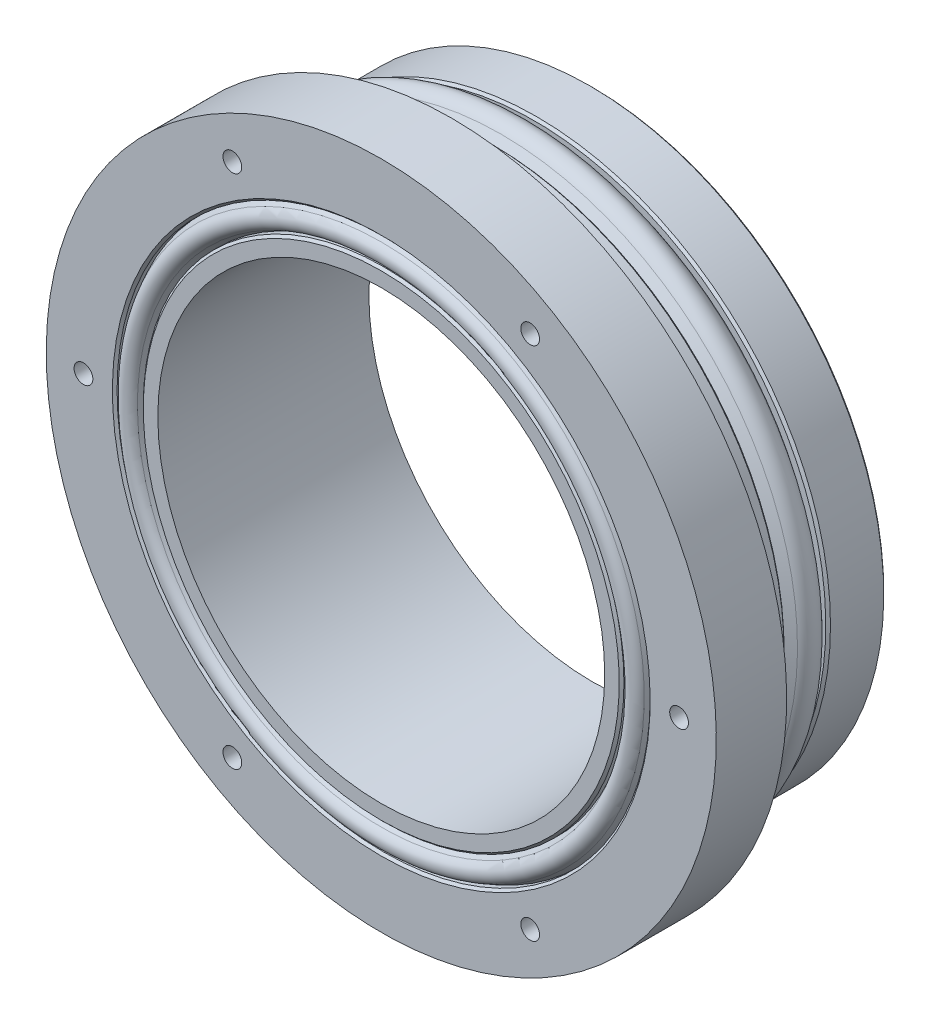
ISO-10303-21;
HEADER;
FILE_DESCRIPTION(('STEP AP214'),'2;1');
FILE_NAME('part.step','',(''),(''),'','','');
FILE_SCHEMA(('AUTOMOTIVE_DESIGN { 1 0 10303 214 1 1 1 1 }'));
ENDSEC;
DATA;
#1=APPLICATION_CONTEXT('core data for automotive mechanical design processes');
#2=APPLICATION_PROTOCOL_DEFINITION('international standard','automotive_design',2000,#1);
#3=PRODUCT_CONTEXT('',#1,'mechanical');
#4=PRODUCT('Part','Part','',(#3));
#5=PRODUCT_RELATED_PRODUCT_CATEGORY('part','',(#4));
#6=PRODUCT_DEFINITION_FORMATION('','',#4);
#7=PRODUCT_DEFINITION_CONTEXT('part definition',#1,'design');
#8=PRODUCT_DEFINITION('design','',#6,#7);
#9=PRODUCT_DEFINITION_SHAPE('','',#8);
#10=(LENGTH_UNIT() NAMED_UNIT(*) SI_UNIT(.MILLI.,.METRE.));
#11=(NAMED_UNIT(*) PLANE_ANGLE_UNIT() SI_UNIT($,.RADIAN.));
#12=(NAMED_UNIT(*) SI_UNIT($,.STERADIAN.) SOLID_ANGLE_UNIT());
#13=UNCERTAINTY_MEASURE_WITH_UNIT(LENGTH_MEASURE(1.E-05),#10,'distance_accuracy_value','');
#14=(GEOMETRIC_REPRESENTATION_CONTEXT(3) GLOBAL_UNCERTAINTY_ASSIGNED_CONTEXT((#13)) GLOBAL_UNIT_ASSIGNED_CONTEXT((#10,
#11,#12)) REPRESENTATION_CONTEXT('',''));
#15=CARTESIAN_POINT('',(0.,0.,0.));
#16=DIRECTION('',(0.,0.,1.));
#17=DIRECTION('',(1.,0.,0.));
#18=AXIS2_PLACEMENT_3D('',#15,#16,#17);
#19=CARTESIAN_POINT('',(0.,19.0571,0.));
#20=DIRECTION('',(0.,0.,-1.));
#21=DIRECTION('',(0.,1.,0.));
#22=AXIS2_PLACEMENT_3D('',#19,#20,#21);
#23=PLANE('',#22);
#24=CARTESIAN_POINT('',(21.5,0.,0.));
#25=DIRECTION('',(0.,0.,-1.));
#26=DIRECTION('',(0.,1.,0.));
#27=AXIS2_PLACEMENT_3D('',#24,#25,#26);
#28=CIRCLE('',#27,1.25);
#29=CARTESIAN_POINT('',(21.5,1.25,0.));
#30=VERTEX_POINT('',#29);
#31=EDGE_CURVE('E162',#30,#30,#28,.T.);
#32=ORIENTED_EDGE('',*,*,#31,.F.);
#33=EDGE_LOOP('',(#32));
#34=FACE_BOUND('',#33,.T.);
#35=CARTESIAN_POINT('',(0.,-21.5,0.));
#36=DIRECTION('',(0.,0.,-1.));
#37=DIRECTION('',(0.,1.,0.));
#38=AXIS2_PLACEMENT_3D('',#35,#36,#37);
#39=CIRCLE('',#38,1.25);
#40=CARTESIAN_POINT('',(0.,-20.25,0.));
#41=VERTEX_POINT('',#40);
#42=EDGE_CURVE('E156',#41,#41,#39,.T.);
#43=ORIENTED_EDGE('',*,*,#42,.F.);
#44=EDGE_LOOP('',(#43));
#45=FACE_BOUND('',#44,.T.);
#46=CARTESIAN_POINT('',(-21.5,0.,0.));
#47=DIRECTION('',(0.,0.,-1.));
#48=DIRECTION('',(0.,1.,0.));
#49=AXIS2_PLACEMENT_3D('',#46,#47,#48);
#50=CIRCLE('',#49,1.25);
#51=CARTESIAN_POINT('',(-21.5,1.25,0.));
#52=VERTEX_POINT('',#51);
#53=EDGE_CURVE('E150',#52,#52,#50,.T.);
#54=ORIENTED_EDGE('',*,*,#53,.F.);
#55=EDGE_LOOP('',(#54));
#56=FACE_BOUND('',#55,.T.);
#57=CARTESIAN_POINT('',(0.,21.5,0.));
#58=DIRECTION('',(0.,0.,-1.));
#59=DIRECTION('',(0.,1.,0.));
#60=AXIS2_PLACEMENT_3D('',#57,#58,#59);
#61=CIRCLE('',#60,1.25);
#62=CARTESIAN_POINT('',(0.,22.75,0.));
#63=VERTEX_POINT('',#62);
#64=EDGE_CURVE('E144',#63,#63,#61,.T.);
#65=ORIENTED_EDGE('',*,*,#64,.F.);
#66=EDGE_LOOP('',(#65));
#67=FACE_BOUND('',#66,.T.);
#68=CARTESIAN_POINT('',(0.,0.,0.));
#69=DIRECTION('',(0.,0.,-1.));
#70=DIRECTION('',(0.,1.,0.));
#71=AXIS2_PLACEMENT_3D('',#68,#69,#70);
#72=CIRCLE('',#71,24.8571);
#73=CARTESIAN_POINT('',(0.,24.8571,0.));
#74=VERTEX_POINT('',#73);
#75=EDGE_CURVE('E41',#74,#74,#72,.T.);
#76=ORIENTED_EDGE('',*,*,#75,.T.);
#77=EDGE_LOOP('',(#76));
#78=FACE_BOUND('',#77,.T.);
#79=CARTESIAN_POINT('',(0.,0.,0.));
#80=DIRECTION('',(0.,0.,-1.));
#81=DIRECTION('',(0.,1.,0.));
#82=AXIS2_PLACEMENT_3D('',#79,#80,#81);
#83=CIRCLE('',#82,19.0571);
#84=CARTESIAN_POINT('',(0.,19.0571,0.));
#85=VERTEX_POINT('',#84);
#86=EDGE_CURVE('E104',#85,#85,#83,.T.);
#87=ORIENTED_EDGE('',*,*,#86,.F.);
#88=EDGE_LOOP('',(#87));
#89=FACE_BOUND('',#88,.T.);
#90=ADVANCED_FACE('F30',(#34,#45,#56,#67,#78,#89),#23,.T.);
#91=CARTESIAN_POINT('',(0.,0.,0.));
#92=DIRECTION('',(0.,0.,-1.));
#93=DIRECTION('',(0.,1.,0.));
#94=AXIS2_PLACEMENT_3D('',#91,#92,#93);
#95=CYLINDRICAL_SURFACE('',#94,25.0571);
#96=CARTESIAN_POINT('',(0.,0.,4.74400000000002));
#97=DIRECTION('',(0.,0.,1.));
#98=DIRECTION('',(0.,-1.,0.));
#99=AXIS2_PLACEMENT_3D('',#96,#97,#98);
#100=CIRCLE('',#99,25.0571);
#101=CARTESIAN_POINT('',(0.,-25.0571,4.74400000000001));
#102=VERTEX_POINT('',#101);
#103=EDGE_CURVE('E56',#102,#102,#100,.F.);
#104=ORIENTED_EDGE('',*,*,#103,.T.);
#105=EDGE_LOOP('',(#104));
#106=FACE_BOUND('',#105,.T.);
#107=CARTESIAN_POINT('',(0.,0.,0.199999999999987));
#108=DIRECTION('',(0.,0.,-1.));
#109=DIRECTION('',(0.,1.,0.));
#110=AXIS2_PLACEMENT_3D('',#107,#108,#109);
#111=CIRCLE('',#110,25.0571);
#112=CARTESIAN_POINT('',(0.,25.0571,0.19999999999999));
#113=VERTEX_POINT('',#112);
#114=EDGE_CURVE('E59',#113,#113,#111,.F.);
#115=ORIENTED_EDGE('',*,*,#114,.T.);
#116=EDGE_LOOP('',(#115));
#117=FACE_BOUND('',#116,.T.);
#118=ADVANCED_FACE('F179',(#106,#117),#95,.T.);
#119=CARTESIAN_POINT('',(0.,24.2951,4.944));
#120=DIRECTION('',(0.,0.,1.));
#121=DIRECTION('',(0.,-1.,0.));
#122=AXIS2_PLACEMENT_3D('',#119,#120,#121);
#123=PLANE('',#122);
#124=CARTESIAN_POINT('',(0.,0.,4.944));
#125=DIRECTION('',(0.,0.,1.));
#126=DIRECTION('',(0.,-1.,0.));
#127=AXIS2_PLACEMENT_3D('',#124,#125,#126);
#128=CIRCLE('',#127,24.8571);
#129=CARTESIAN_POINT('',(0.,-24.8571,4.944));
#130=VERTEX_POINT('',#129);
#131=EDGE_CURVE('E53',#130,#130,#128,.T.);
#132=ORIENTED_EDGE('',*,*,#131,.T.);
#133=EDGE_LOOP('',(#132));
#134=FACE_BOUND('',#133,.T.);
#135=CARTESIAN_POINT('',(0.,0.,4.944));
#136=DIRECTION('',(0.,0.,-1.));
#137=DIRECTION('',(0.,1.,0.));
#138=AXIS2_PLACEMENT_3D('',#135,#136,#137);
#139=CIRCLE('',#138,24.2951);
#140=CARTESIAN_POINT('',(0.,24.2951,4.94400000000001));
#141=VERTEX_POINT('',#140);
#142=EDGE_CURVE('E68',#141,#141,#139,.T.);
#143=ORIENTED_EDGE('',*,*,#142,.T.);
#144=EDGE_LOOP('',(#143));
#145=FACE_BOUND('',#144,.T.);
#146=ADVANCED_FACE('F255',(#134,#145),#123,.T.);
#147=CARTESIAN_POINT('',(0.,0.,4.944));
#148=DIRECTION('',(0.,0.,1.));
#149=DIRECTION('',(0.,-1.,0.));
#150=AXIS2_PLACEMENT_3D('',#147,#148,#149);
#151=CONICAL_SURFACE('',#150,24.2951,0.921014122240869);
#152=CARTESIAN_POINT('',(0.,0.,5.68047039128616));
#153=DIRECTION('',(0.,0.,-1.));
#154=DIRECTION('',(0.,1.,0.));
#155=AXIS2_PLACEMENT_3D('',#152,#153,#154);
#156=CIRCLE('',#155,25.2643175157099);
#157=CARTESIAN_POINT('',(0.,25.2643175157099,5.68047039128616));
#158=VERTEX_POINT('',#157);
#159=EDGE_CURVE('E71',#158,#158,#156,.T.);
#160=ORIENTED_EDGE('',*,*,#159,.T.);
#161=EDGE_LOOP('',(#160));
#162=FACE_BOUND('',#161,.T.);
#163=ORIENTED_EDGE('',*,*,#142,.F.);
#164=EDGE_LOOP('',(#163));
#165=FACE_BOUND('',#164,.T.);
#166=ADVANCED_FACE('F251',(#162,#165),#151,.T.);
#167=CARTESIAN_POINT('',(0.,0.,6.722));
#168=DIRECTION('',(0.,0.,-1.));
#169=DIRECTION('',(0.,1.,0.));
#170=AXIS2_PLACEMENT_3D('',#167,#168,#169);
#171=TOROIDAL_SURFACE('',#170,24.4729,1.3081);
#172=CARTESIAN_POINT('',(0.,0.,7.76352960871384));
#173=DIRECTION('',(0.,0.,-1.));
#174=DIRECTION('',(0.,1.,0.));
#175=AXIS2_PLACEMENT_3D('',#172,#173,#174);
#176=CIRCLE('',#175,25.2643175157099);
#177=CARTESIAN_POINT('',(0.,25.2643175157099,7.76352960871385));
#178=VERTEX_POINT('',#177);
#179=EDGE_CURVE('E74',#178,#178,#176,.T.);
#180=ORIENTED_EDGE('',*,*,#179,.T.);
#181=EDGE_LOOP('',(#180));
#182=FACE_BOUND('',#181,.T.);
#183=ORIENTED_EDGE('',*,*,#159,.F.);
#184=EDGE_LOOP('',(#183));
#185=FACE_BOUND('',#184,.T.);
#186=ADVANCED_FACE('F247',(#182,#185),#171,.T.);
#187=CARTESIAN_POINT('',(0.,0.,7.76352960871384));
#188=DIRECTION('',(0.,0.,-1.));
#189=DIRECTION('',(0.,1.,0.));
#190=AXIS2_PLACEMENT_3D('',#187,#188,#189);
#191=CONICAL_SURFACE('',#190,25.2643175157099,0.921014122240869);
#192=CARTESIAN_POINT('',(0.,0.,8.5));
#193=DIRECTION('',(0.,0.,-1.));
#194=DIRECTION('',(0.,1.,0.));
#195=AXIS2_PLACEMENT_3D('',#192,#193,#194);
#196=CIRCLE('',#195,24.2951);
#197=CARTESIAN_POINT('',(0.,24.2951,8.5));
#198=VERTEX_POINT('',#197);
#199=EDGE_CURVE('E77',#198,#198,#196,.T.);
#200=ORIENTED_EDGE('',*,*,#199,.T.);
#201=EDGE_LOOP('',(#200));
#202=FACE_BOUND('',#201,.T.);
#203=ORIENTED_EDGE('',*,*,#179,.F.);
#204=EDGE_LOOP('',(#203));
#205=FACE_BOUND('',#204,.T.);
#206=ADVANCED_FACE('F244',(#202,#205),#191,.T.);
#207=CARTESIAN_POINT('',(0.,25.0571,8.5));
#208=DIRECTION('',(0.,0.,-1.));
#209=DIRECTION('',(0.,1.,0.));
#210=AXIS2_PLACEMENT_3D('',#207,#208,#209);
#211=PLANE('',#210);
#212=CARTESIAN_POINT('',(0.,0.,8.49999999999999));
#213=DIRECTION('',(0.,0.,-1.));
#214=DIRECTION('',(0.,1.,0.));
#215=AXIS2_PLACEMENT_3D('',#212,#213,#214);
#216=CIRCLE('',#215,24.8571);
#217=CARTESIAN_POINT('',(0.,24.8571,8.5));
#218=VERTEX_POINT('',#217);
#219=EDGE_CURVE('E37',#218,#218,#216,.T.);
#220=ORIENTED_EDGE('',*,*,#219,.T.);
#221=EDGE_LOOP('',(#220));
#222=FACE_BOUND('',#221,.T.);
#223=ORIENTED_EDGE('',*,*,#199,.F.);
#224=EDGE_LOOP('',(#223));
#225=FACE_BOUND('',#224,.T.);
#226=ADVANCED_FACE('F241',(#222,#225),#211,.T.);
#227=CARTESIAN_POINT('',(0.,0.,0.));
#228=DIRECTION('',(0.,0.,-1.));
#229=DIRECTION('',(0.,1.,0.));
#230=AXIS2_PLACEMENT_3D('',#227,#228,#229);
#231=CYLINDRICAL_SURFACE('',#230,25.0571);
#232=CARTESIAN_POINT('',(0.,0.,8.7));
#233=DIRECTION('',(0.,0.,-1.));
#234=DIRECTION('',(0.,1.,0.));
#235=AXIS2_PLACEMENT_3D('',#232,#233,#234);
#236=CIRCLE('',#235,25.0571);
#237=CARTESIAN_POINT('',(0.,25.0571,8.7));
#238=VERTEX_POINT('',#237);
#239=EDGE_CURVE('E10',#238,#238,#236,.F.);
#240=ORIENTED_EDGE('',*,*,#239,.T.);
#241=EDGE_LOOP('',(#240));
#242=FACE_BOUND('',#241,.T.);
#243=CARTESIAN_POINT('',(0.,0.,12.));
#244=DIRECTION('',(0.,0.,-1.));
#245=DIRECTION('',(0.,1.,0.));
#246=AXIS2_PLACEMENT_3D('',#243,#244,#245);
#247=CIRCLE('',#246,25.0571);
#248=CARTESIAN_POINT('',(0.,25.0571,12.));
#249=VERTEX_POINT('',#248);
#250=EDGE_CURVE('E80',#249,#249,#247,.T.);
#251=ORIENTED_EDGE('',*,*,#250,.T.);
#252=EDGE_LOOP('',(#251));
#253=FACE_BOUND('',#252,.T.);
#254=ADVANCED_FACE('F237',(#242,#253),#231,.T.);
#255=CARTESIAN_POINT('',(0.,25.0571,12.));
#256=DIRECTION('',(0.,0.,-1.));
#257=DIRECTION('',(0.,1.,0.));
#258=AXIS2_PLACEMENT_3D('',#255,#256,#257);
#259=PLANE('',#258);
#260=CARTESIAN_POINT('',(0.,0.,12.));
#261=DIRECTION('',(0.,0.,-1.));
#262=DIRECTION('',(0.,1.,0.));
#263=AXIS2_PLACEMENT_3D('',#260,#261,#262);
#264=CIRCLE('',#263,28.575);
#265=CARTESIAN_POINT('',(0.,28.575,12.));
#266=VERTEX_POINT('',#265);
#267=EDGE_CURVE('E83',#266,#266,#264,.T.);
#268=ORIENTED_EDGE('',*,*,#267,.T.);
#269=EDGE_LOOP('',(#268));
#270=FACE_BOUND('',#269,.T.);
#271=ORIENTED_EDGE('',*,*,#250,.F.);
#272=EDGE_LOOP('',(#271));
#273=FACE_BOUND('',#272,.T.);
#274=ADVANCED_FACE('F233',(#270,#273),#259,.T.);
#275=CARTESIAN_POINT('',(0.,0.,0.));
#276=DIRECTION('',(0.,0.,-1.));
#277=DIRECTION('',(0.,1.,0.));
#278=AXIS2_PLACEMENT_3D('',#275,#276,#277);
#279=CYLINDRICAL_SURFACE('',#278,28.575);
#280=CARTESIAN_POINT('',(0.,0.,18.));
#281=DIRECTION('',(0.,0.,-1.));
#282=DIRECTION('',(0.,1.,0.));
#283=AXIS2_PLACEMENT_3D('',#280,#281,#282);
#284=CIRCLE('',#283,28.575);
#285=CARTESIAN_POINT('',(0.,28.575,18.));
#286=VERTEX_POINT('',#285);
#287=EDGE_CURVE('E86',#286,#286,#284,.T.);
#288=ORIENTED_EDGE('',*,*,#287,.T.);
#289=EDGE_LOOP('',(#288));
#290=FACE_BOUND('',#289,.T.);
#291=ORIENTED_EDGE('',*,*,#267,.F.);
#292=EDGE_LOOP('',(#291));
#293=FACE_BOUND('',#292,.T.);
#294=ADVANCED_FACE('F229',(#290,#293),#279,.T.);
#295=CARTESIAN_POINT('',(0.,28.575,18.));
#296=DIRECTION('',(0.,0.,1.));
#297=DIRECTION('',(0.,-1.,0.));
#298=AXIS2_PLACEMENT_3D('',#295,#296,#297);
#299=PLANE('',#298);
#300=CARTESIAN_POINT('',(0.,0.,18.));
#301=DIRECTION('',(0.,0.,1.));
#302=DIRECTION('',(0.,-1.,0.));
#303=AXIS2_PLACEMENT_3D('',#300,#301,#302);
#304=CIRCLE('',#303,22.933);
#305=CARTESIAN_POINT('',(0.,-22.933,18.));
#306=VERTEX_POINT('',#305);
#307=EDGE_CURVE('E65',#306,#306,#304,.F.);
#308=ORIENTED_EDGE('',*,*,#307,.T.);
#309=EDGE_LOOP('',(#308));
#310=FACE_BOUND('',#309,.T.);
#311=CARTESIAN_POINT('',(-12.7,-21.9970452561248,18.));
#312=DIRECTION('',(0.,0.,1.));
#313=DIRECTION('',(1.,0.,0.));
#314=AXIS2_PLACEMENT_3D('',#311,#312,#313);
#315=CIRCLE('',#314,0.8);
#316=CARTESIAN_POINT('',(-11.9,-21.9970452561248,18.));
#317=VERTEX_POINT('',#316);
#318=EDGE_CURVE('E138',#317,#317,#315,.T.);
#319=ORIENTED_EDGE('',*,*,#318,.F.);
#320=EDGE_LOOP('',(#319));
#321=FACE_BOUND('',#320,.T.);
#322=CARTESIAN_POINT('',(25.4,0.,18.));
#323=DIRECTION('',(0.,0.,1.));
#324=DIRECTION('',(1.,0.,0.));
#325=AXIS2_PLACEMENT_3D('',#322,#323,#324);
#326=CIRCLE('',#325,0.799999999999999);
#327=CARTESIAN_POINT('',(26.2,0.,18.));
#328=VERTEX_POINT('',#327);
#329=EDGE_CURVE('E132',#328,#328,#326,.T.);
#330=ORIENTED_EDGE('',*,*,#329,.F.);
#331=EDGE_LOOP('',(#330));
#332=FACE_BOUND('',#331,.T.);
#333=CARTESIAN_POINT('',(12.7,21.9970452561247,18.));
#334=DIRECTION('',(0.,0.,1.));
#335=DIRECTION('',(1.,0.,0.));
#336=AXIS2_PLACEMENT_3D('',#333,#334,#335);
#337=CIRCLE('',#336,0.8);
#338=CARTESIAN_POINT('',(13.5,21.9970452561247,18.));
#339=VERTEX_POINT('',#338);
#340=EDGE_CURVE('E126',#339,#339,#337,.T.);
#341=ORIENTED_EDGE('',*,*,#340,.F.);
#342=EDGE_LOOP('',(#341));
#343=FACE_BOUND('',#342,.T.);
#344=CARTESIAN_POINT('',(-12.7,21.9970452561247,18.));
#345=DIRECTION('',(0.,0.,1.));
#346=DIRECTION('',(1.,0.,0.));
#347=AXIS2_PLACEMENT_3D('',#344,#345,#346);
#348=CIRCLE('',#347,0.8);
#349=CARTESIAN_POINT('',(-11.9,21.9970452561247,18.));
#350=VERTEX_POINT('',#349);
#351=EDGE_CURVE('E120',#350,#350,#348,.T.);
#352=ORIENTED_EDGE('',*,*,#351,.F.);
#353=EDGE_LOOP('',(#352));
#354=FACE_BOUND('',#353,.T.);
#355=CARTESIAN_POINT('',(12.7,-21.9970452561247,18.));
#356=DIRECTION('',(0.,0.,1.));
#357=DIRECTION('',(1.,0.,0.));
#358=AXIS2_PLACEMENT_3D('',#355,#356,#357);
#359=CIRCLE('',#358,0.8);
#360=CARTESIAN_POINT('',(13.5,-21.9970452561247,18.));
#361=VERTEX_POINT('',#360);
#362=EDGE_CURVE('E114',#361,#361,#359,.T.);
#363=ORIENTED_EDGE('',*,*,#362,.F.);
#364=EDGE_LOOP('',(#363));
#365=FACE_BOUND('',#364,.T.);
#366=CARTESIAN_POINT('',(-25.4,0.,18.));
#367=DIRECTION('',(0.,0.,1.));
#368=DIRECTION('',(1.,0.,0.));
#369=AXIS2_PLACEMENT_3D('',#366,#367,#368);
#370=CIRCLE('',#369,0.799999999999999);
#371=CARTESIAN_POINT('',(-24.6,0.,18.));
#372=VERTEX_POINT('',#371);
#373=EDGE_CURVE('E108',#372,#372,#370,.T.);
#374=ORIENTED_EDGE('',*,*,#373,.F.);
#375=EDGE_LOOP('',(#374));
#376=FACE_BOUND('',#375,.T.);
#377=ORIENTED_EDGE('',*,*,#287,.F.);
#378=EDGE_LOOP('',(#377));
#379=FACE_BOUND('',#378,.T.);
#380=ADVANCED_FACE('F225',(#310,#321,#332,#343,#354,#365,#376,#379),#299,.T.);
#381=CARTESIAN_POINT('',(0.,0.,0.));
#382=DIRECTION('',(0.,0.,-1.));
#383=DIRECTION('',(0.,1.,0.));
#384=AXIS2_PLACEMENT_3D('',#381,#382,#383);
#385=CYLINDRICAL_SURFACE('',#384,22.733);
#386=CARTESIAN_POINT('',(0.,0.,17.8));
#387=DIRECTION('',(0.,0.,1.));
#388=DIRECTION('',(0.,-1.,0.));
#389=AXIS2_PLACEMENT_3D('',#386,#387,#388);
#390=CIRCLE('',#389,22.733);
#391=CARTESIAN_POINT('',(0.,-22.733,17.8));
#392=VERTEX_POINT('',#391);
#393=EDGE_CURVE('E62',#392,#392,#390,.T.);
#394=ORIENTED_EDGE('',*,*,#393,.T.);
#395=EDGE_LOOP('',(#394));
#396=FACE_BOUND('',#395,.T.);
#397=CARTESIAN_POINT('',(0.,0.,17.3396));
#398=DIRECTION('',(0.,0.,-1.));
#399=DIRECTION('',(0.,1.,0.));
#400=AXIS2_PLACEMENT_3D('',#397,#398,#399);
#401=CIRCLE('',#400,22.733);
#402=CARTESIAN_POINT('',(0.,22.733,17.3396));
#403=VERTEX_POINT('',#402);
#404=EDGE_CURVE('E89',#403,#403,#401,.T.);
#405=ORIENTED_EDGE('',*,*,#404,.T.);
#406=EDGE_LOOP('',(#405));
#407=FACE_BOUND('',#406,.T.);
#408=ADVANCED_FACE('F221',(#396,#407),#385,.F.);
#409=CARTESIAN_POINT('',(0.,0.,17.3396));
#410=DIRECTION('',(0.,0.,-1.));
#411=DIRECTION('',(0.,1.,0.));
#412=AXIS2_PLACEMENT_3D('',#409,#410,#411);
#413=CONICAL_SURFACE('',#412,22.733,0.475456156031147);
#414=CARTESIAN_POINT('',(0.,0.,17.9751344656259));
#415=DIRECTION('',(0.,0.,-1.));
#416=DIRECTION('',(0.,1.,0.));
#417=AXIS2_PLACEMENT_3D('',#414,#415,#416);
#418=CIRCLE('',#417,22.4057956861508);
#419=CARTESIAN_POINT('',(0.,22.4057956861508,17.9751344656259));
#420=VERTEX_POINT('',#419);
#421=EDGE_CURVE('E92',#420,#420,#418,.T.);
#422=ORIENTED_EDGE('',*,*,#421,.T.);
#423=EDGE_LOOP('',(#422));
#424=FACE_BOUND('',#423,.T.);
#425=ORIENTED_EDGE('',*,*,#404,.F.);
#426=EDGE_LOOP('',(#425));
#427=FACE_BOUND('',#426,.T.);
#428=ADVANCED_FACE('F217',(#424,#427),#413,.T.);
#429=CARTESIAN_POINT('',(0.,0.,17.5682));
#430=DIRECTION('',(0.,0.,-1.));
#431=DIRECTION('',(0.,1.,0.));
#432=AXIS2_PLACEMENT_3D('',#429,#430,#431);
#433=TOROIDAL_SURFACE('',#432,21.6154,0.889000000000001);
#434=CARTESIAN_POINT('',(0.,0.,17.9751344656259));
#435=DIRECTION('',(0.,0.,-1.));
#436=DIRECTION('',(0.,1.,0.));
#437=AXIS2_PLACEMENT_3D('',#434,#435,#436);
#438=CIRCLE('',#437,20.8250043138492);
#439=CARTESIAN_POINT('',(0.,20.8250043138492,17.9751344656259));
#440=VERTEX_POINT('',#439);
#441=EDGE_CURVE('E95',#440,#440,#438,.T.);
#442=ORIENTED_EDGE('',*,*,#441,.T.);
#443=EDGE_LOOP('',(#442));
#444=FACE_BOUND('',#443,.T.);
#445=ORIENTED_EDGE('',*,*,#421,.F.);
#446=EDGE_LOOP('',(#445));
#447=FACE_BOUND('',#446,.T.);
#448=ADVANCED_FACE('F213',(#444,#447),#433,.T.);
#449=CARTESIAN_POINT('',(0.,0.,17.9751344656259));
#450=DIRECTION('',(0.,0.,1.));
#451=DIRECTION('',(0.,-1.,0.));
#452=AXIS2_PLACEMENT_3D('',#449,#450,#451);
#453=CONICAL_SURFACE('',#452,20.8250043138492,0.475456156031149);
#454=CARTESIAN_POINT('',(0.,0.,17.3396));
#455=DIRECTION('',(0.,0.,-1.));
#456=DIRECTION('',(0.,1.,0.));
#457=AXIS2_PLACEMENT_3D('',#454,#455,#456);
#458=CIRCLE('',#457,20.4978);
#459=CARTESIAN_POINT('',(0.,20.4978,17.3396));
#460=VERTEX_POINT('',#459);
#461=EDGE_CURVE('E98',#460,#460,#458,.T.);
#462=ORIENTED_EDGE('',*,*,#461,.T.);
#463=EDGE_LOOP('',(#462));
#464=FACE_BOUND('',#463,.T.);
#465=ORIENTED_EDGE('',*,*,#441,.F.);
#466=EDGE_LOOP('',(#465));
#467=FACE_BOUND('',#466,.T.);
#468=ADVANCED_FACE('F206',(#464,#467),#453,.F.);
#469=CARTESIAN_POINT('',(0.,0.,0.));
#470=DIRECTION('',(0.,0.,-1.));
#471=DIRECTION('',(0.,1.,0.));
#472=AXIS2_PLACEMENT_3D('',#469,#470,#471);
#473=CYLINDRICAL_SURFACE('',#472,20.4978);
#474=CARTESIAN_POINT('',(0.,0.,17.8));
#475=DIRECTION('',(0.,0.,1.));
#476=DIRECTION('',(0.,-1.,0.));
#477=AXIS2_PLACEMENT_3D('',#474,#475,#476);
#478=CIRCLE('',#477,20.4978);
#479=CARTESIAN_POINT('',(0.,-20.4978,17.8));
#480=VERTEX_POINT('',#479);
#481=EDGE_CURVE('E50',#480,#480,#478,.F.);
#482=ORIENTED_EDGE('',*,*,#481,.T.);
#483=EDGE_LOOP('',(#482));
#484=FACE_BOUND('',#483,.T.);
#485=ORIENTED_EDGE('',*,*,#461,.F.);
#486=EDGE_LOOP('',(#485));
#487=FACE_BOUND('',#486,.T.);
#488=ADVANCED_FACE('F200',(#484,#487),#473,.T.);
#489=CARTESIAN_POINT('',(0.,20.4978,18.));
#490=DIRECTION('',(0.,0.,1.));
#491=DIRECTION('',(0.,-1.,0.));
#492=AXIS2_PLACEMENT_3D('',#489,#490,#491);
#493=PLANE('',#492);
#494=CARTESIAN_POINT('',(0.,0.,18.));
#495=DIRECTION('',(0.,0.,1.));
#496=DIRECTION('',(0.,-1.,0.));
#497=AXIS2_PLACEMENT_3D('',#494,#495,#496);
#498=CIRCLE('',#497,20.2978);
#499=CARTESIAN_POINT('',(0.,-20.2978,18.));
#500=VERTEX_POINT('',#499);
#501=EDGE_CURVE('E45',#500,#500,#498,.T.);
#502=ORIENTED_EDGE('',*,*,#501,.T.);
#503=EDGE_LOOP('',(#502));
#504=FACE_BOUND('',#503,.T.);
#505=CARTESIAN_POINT('',(0.,0.,18.));
#506=DIRECTION('',(0.,0.,-1.));
#507=DIRECTION('',(0.,1.,0.));
#508=AXIS2_PLACEMENT_3D('',#505,#506,#507);
#509=CIRCLE('',#508,19.0571);
#510=CARTESIAN_POINT('',(0.,19.0571,18.));
#511=VERTEX_POINT('',#510);
#512=EDGE_CURVE('E101',#511,#511,#509,.T.);
#513=ORIENTED_EDGE('',*,*,#512,.T.);
#514=EDGE_LOOP('',(#513));
#515=FACE_BOUND('',#514,.T.);
#516=ADVANCED_FACE('F195',(#504,#515),#493,.T.);
#517=CARTESIAN_POINT('',(0.,0.,0.));
#518=DIRECTION('',(0.,0.,-1.));
#519=DIRECTION('',(0.,1.,0.));
#520=AXIS2_PLACEMENT_3D('',#517,#518,#519);
#521=CYLINDRICAL_SURFACE('',#520,19.0571);
#522=ORIENTED_EDGE('',*,*,#86,.T.);
#523=EDGE_LOOP('',(#522));
#524=FACE_BOUND('',#523,.T.);
#525=ORIENTED_EDGE('',*,*,#512,.F.);
#526=EDGE_LOOP('',(#525));
#527=FACE_BOUND('',#526,.T.);
#528=ADVANCED_FACE('F191',(#524,#527),#521,.F.);
#529=CARTESIAN_POINT('',(-25.4,0.,14.5));
#530=DIRECTION('',(0.,0.,1.));
#531=DIRECTION('',(1.,0.,0.));
#532=AXIS2_PLACEMENT_3D('',#529,#530,#531);
#533=CYLINDRICAL_SURFACE('',#532,0.799999999999999);
#534=CARTESIAN_POINT('',(-25.4,0.,14.5));
#535=DIRECTION('',(0.,0.,1.));
#536=DIRECTION('',(1.,0.,0.));
#537=AXIS2_PLACEMENT_3D('',#534,#535,#536);
#538=CIRCLE('',#537,0.799999999999999);
#539=CARTESIAN_POINT('',(-24.6,0.,14.5));
#540=VERTEX_POINT('',#539);
#541=EDGE_CURVE('E107',#540,#540,#538,.T.);
#542=ORIENTED_EDGE('',*,*,#541,.F.);
#543=EDGE_LOOP('',(#542));
#544=FACE_BOUND('',#543,.T.);
#545=ORIENTED_EDGE('',*,*,#373,.T.);
#546=EDGE_LOOP('',(#545));
#547=FACE_BOUND('',#546,.T.);
#548=ADVANCED_FACE('F194',(#544,#547),#533,.F.);
#549=CARTESIAN_POINT('',(-25.4,0.,14.5));
#550=DIRECTION('',(0.,0.,1.));
#551=DIRECTION('',(1.,0.,0.));
#552=AXIS2_PLACEMENT_3D('',#549,#550,#551);
#553=PLANE('',#552);
#554=ORIENTED_EDGE('',*,*,#541,.T.);
#555=EDGE_LOOP('',(#554));
#556=FACE_BOUND('',#555,.T.);
#557=ADVANCED_FACE('F341',(#556),#553,.T.);
#558=CARTESIAN_POINT('',(12.7,-21.9970452561247,14.5));
#559=DIRECTION('',(0.,0.,1.));
#560=DIRECTION('',(1.,0.,0.));
#561=AXIS2_PLACEMENT_3D('',#558,#559,#560);
#562=CYLINDRICAL_SURFACE('',#561,0.8);
#563=CARTESIAN_POINT('',(12.7,-21.9970452561247,14.5));
#564=DIRECTION('',(0.,0.,1.));
#565=DIRECTION('',(1.,0.,0.));
#566=AXIS2_PLACEMENT_3D('',#563,#564,#565);
#567=CIRCLE('',#566,0.8);
#568=CARTESIAN_POINT('',(13.5,-21.9970452561247,14.5));
#569=VERTEX_POINT('',#568);
#570=EDGE_CURVE('E111',#569,#569,#567,.T.);
#571=ORIENTED_EDGE('',*,*,#570,.F.);
#572=EDGE_LOOP('',(#571));
#573=FACE_BOUND('',#572,.T.);
#574=ORIENTED_EDGE('',*,*,#362,.T.);
#575=EDGE_LOOP('',(#574));
#576=FACE_BOUND('',#575,.T.);
#577=ADVANCED_FACE('F337',(#573,#576),#562,.F.);
#578=CARTESIAN_POINT('',(12.7,-21.9970452561247,14.5));
#579=DIRECTION('',(0.,0.,1.));
#580=DIRECTION('',(1.,0.,0.));
#581=AXIS2_PLACEMENT_3D('',#578,#579,#580);
#582=PLANE('',#581);
#583=ORIENTED_EDGE('',*,*,#570,.T.);
#584=EDGE_LOOP('',(#583));
#585=FACE_BOUND('',#584,.T.);
#586=ADVANCED_FACE('F333',(#585),#582,.T.);
#587=CARTESIAN_POINT('',(-12.7,21.9970452561247,14.5));
#588=DIRECTION('',(0.,0.,1.));
#589=DIRECTION('',(1.,0.,0.));
#590=AXIS2_PLACEMENT_3D('',#587,#588,#589);
#591=CYLINDRICAL_SURFACE('',#590,0.8);
#592=CARTESIAN_POINT('',(-12.7,21.9970452561247,14.5));
#593=DIRECTION('',(0.,0.,1.));
#594=DIRECTION('',(1.,0.,0.));
#595=AXIS2_PLACEMENT_3D('',#592,#593,#594);
#596=CIRCLE('',#595,0.8);
#597=CARTESIAN_POINT('',(-11.9,21.9970452561247,14.5));
#598=VERTEX_POINT('',#597);
#599=EDGE_CURVE('E117',#598,#598,#596,.T.);
#600=ORIENTED_EDGE('',*,*,#599,.F.);
#601=EDGE_LOOP('',(#600));
#602=FACE_BOUND('',#601,.T.);
#603=ORIENTED_EDGE('',*,*,#351,.T.);
#604=EDGE_LOOP('',(#603));
#605=FACE_BOUND('',#604,.T.);
#606=ADVANCED_FACE('F329',(#602,#605),#591,.F.);
#607=CARTESIAN_POINT('',(-12.7,21.9970452561247,14.5));
#608=DIRECTION('',(0.,0.,1.));
#609=DIRECTION('',(1.,0.,0.));
#610=AXIS2_PLACEMENT_3D('',#607,#608,#609);
#611=PLANE('',#610);
#612=ORIENTED_EDGE('',*,*,#599,.T.);
#613=EDGE_LOOP('',(#612));
#614=FACE_BOUND('',#613,.T.);
#615=ADVANCED_FACE('F325',(#614),#611,.T.);
#616=CARTESIAN_POINT('',(12.7,21.9970452561247,14.5));
#617=DIRECTION('',(0.,0.,1.));
#618=DIRECTION('',(1.,0.,0.));
#619=AXIS2_PLACEMENT_3D('',#616,#617,#618);
#620=CYLINDRICAL_SURFACE('',#619,0.8);
#621=CARTESIAN_POINT('',(12.7,21.9970452561247,14.5));
#622=DIRECTION('',(0.,0.,1.));
#623=DIRECTION('',(1.,0.,0.));
#624=AXIS2_PLACEMENT_3D('',#621,#622,#623);
#625=CIRCLE('',#624,0.8);
#626=CARTESIAN_POINT('',(13.5,21.9970452561247,14.5));
#627=VERTEX_POINT('',#626);
#628=EDGE_CURVE('E123',#627,#627,#625,.T.);
#629=ORIENTED_EDGE('',*,*,#628,.F.);
#630=EDGE_LOOP('',(#629));
#631=FACE_BOUND('',#630,.T.);
#632=ORIENTED_EDGE('',*,*,#340,.T.);
#633=EDGE_LOOP('',(#632));
#634=FACE_BOUND('',#633,.T.);
#635=ADVANCED_FACE('F321',(#631,#634),#620,.F.);
#636=CARTESIAN_POINT('',(12.7,21.9970452561247,14.5));
#637=DIRECTION('',(0.,0.,1.));
#638=DIRECTION('',(1.,0.,0.));
#639=AXIS2_PLACEMENT_3D('',#636,#637,#638);
#640=PLANE('',#639);
#641=ORIENTED_EDGE('',*,*,#628,.T.);
#642=EDGE_LOOP('',(#641));
#643=FACE_BOUND('',#642,.T.);
#644=ADVANCED_FACE('F317',(#643),#640,.T.);
#645=CARTESIAN_POINT('',(25.4,0.,14.5));
#646=DIRECTION('',(0.,0.,1.));
#647=DIRECTION('',(1.,0.,0.));
#648=AXIS2_PLACEMENT_3D('',#645,#646,#647);
#649=CYLINDRICAL_SURFACE('',#648,0.799999999999999);
#650=CARTESIAN_POINT('',(25.4,0.,14.5));
#651=DIRECTION('',(0.,0.,1.));
#652=DIRECTION('',(1.,0.,0.));
#653=AXIS2_PLACEMENT_3D('',#650,#651,#652);
#654=CIRCLE('',#653,0.799999999999999);
#655=CARTESIAN_POINT('',(26.2,0.,14.5));
#656=VERTEX_POINT('',#655);
#657=EDGE_CURVE('E129',#656,#656,#654,.T.);
#658=ORIENTED_EDGE('',*,*,#657,.F.);
#659=EDGE_LOOP('',(#658));
#660=FACE_BOUND('',#659,.T.);
#661=ORIENTED_EDGE('',*,*,#329,.T.);
#662=EDGE_LOOP('',(#661));
#663=FACE_BOUND('',#662,.T.);
#664=ADVANCED_FACE('F313',(#660,#663),#649,.F.);
#665=CARTESIAN_POINT('',(25.4,0.,14.5));
#666=DIRECTION('',(0.,0.,1.));
#667=DIRECTION('',(1.,0.,0.));
#668=AXIS2_PLACEMENT_3D('',#665,#666,#667);
#669=PLANE('',#668);
#670=ORIENTED_EDGE('',*,*,#657,.T.);
#671=EDGE_LOOP('',(#670));
#672=FACE_BOUND('',#671,.T.);
#673=ADVANCED_FACE('F309',(#672),#669,.T.);
#674=CARTESIAN_POINT('',(-12.7,-21.9970452561248,14.5));
#675=DIRECTION('',(0.,0.,1.));
#676=DIRECTION('',(1.,0.,0.));
#677=AXIS2_PLACEMENT_3D('',#674,#675,#676);
#678=CYLINDRICAL_SURFACE('',#677,0.8);
#679=CARTESIAN_POINT('',(-12.7,-21.9970452561248,14.5));
#680=DIRECTION('',(0.,0.,1.));
#681=DIRECTION('',(1.,0.,0.));
#682=AXIS2_PLACEMENT_3D('',#679,#680,#681);
#683=CIRCLE('',#682,0.8);
#684=CARTESIAN_POINT('',(-11.9,-21.9970452561248,14.5));
#685=VERTEX_POINT('',#684);
#686=EDGE_CURVE('E135',#685,#685,#683,.T.);
#687=ORIENTED_EDGE('',*,*,#686,.F.);
#688=EDGE_LOOP('',(#687));
#689=FACE_BOUND('',#688,.T.);
#690=ORIENTED_EDGE('',*,*,#318,.T.);
#691=EDGE_LOOP('',(#690));
#692=FACE_BOUND('',#691,.T.);
#693=ADVANCED_FACE('F305',(#689,#692),#678,.F.);
#694=CARTESIAN_POINT('',(-12.7,-21.9970452561248,14.5));
#695=DIRECTION('',(0.,0.,1.));
#696=DIRECTION('',(1.,0.,0.));
#697=AXIS2_PLACEMENT_3D('',#694,#695,#696);
#698=PLANE('',#697);
#699=ORIENTED_EDGE('',*,*,#686,.T.);
#700=EDGE_LOOP('',(#699));
#701=FACE_BOUND('',#700,.T.);
#702=ADVANCED_FACE('F267',(#701),#698,.T.);
#703=CARTESIAN_POINT('',(0.,0.,18.));
#704=DIRECTION('',(0.,0.,1.));
#705=DIRECTION('',(0.,-1.,0.));
#706=AXIS2_PLACEMENT_3D('',#703,#704,#705);
#707=CONICAL_SURFACE('',#706,22.933,0.785398163397457);
#708=ORIENTED_EDGE('',*,*,#393,.F.);
#709=EDGE_LOOP('',(#708));
#710=FACE_BOUND('',#709,.T.);
#711=ORIENTED_EDGE('',*,*,#307,.F.);
#712=EDGE_LOOP('',(#711));
#713=FACE_BOUND('',#712,.T.);
#714=ADVANCED_FACE('F263',(#710,#713),#707,.F.);
#715=CARTESIAN_POINT('',(0.,0.,4.74400000000002));
#716=DIRECTION('',(0.,0.,-1.));
#717=DIRECTION('',(0.,1.,0.));
#718=AXIS2_PLACEMENT_3D('',#715,#716,#717);
#719=CONICAL_SURFACE('',#718,25.0571,0.785398163397448);
#720=ORIENTED_EDGE('',*,*,#131,.F.);
#721=EDGE_LOOP('',(#720));
#722=FACE_BOUND('',#721,.T.);
#723=ORIENTED_EDGE('',*,*,#103,.F.);
#724=EDGE_LOOP('',(#723));
#725=FACE_BOUND('',#724,.T.);
#726=ADVANCED_FACE('F266',(#722,#725),#719,.T.);
#727=CARTESIAN_POINT('',(0.,0.,17.8));
#728=DIRECTION('',(0.,0.,-1.));
#729=DIRECTION('',(0.,1.,0.));
#730=AXIS2_PLACEMENT_3D('',#727,#728,#729);
#731=CONICAL_SURFACE('',#730,20.4978,0.78539816339744);
#732=ORIENTED_EDGE('',*,*,#501,.F.);
#733=EDGE_LOOP('',(#732));
#734=FACE_BOUND('',#733,.T.);
#735=ORIENTED_EDGE('',*,*,#481,.F.);
#736=EDGE_LOOP('',(#735));
#737=FACE_BOUND('',#736,.T.);
#738=ADVANCED_FACE('F271',(#734,#737),#731,.T.);
#739=CARTESIAN_POINT('',(0.,0.,0.));
#740=DIRECTION('',(0.,0.,1.));
#741=DIRECTION('',(0.,-1.,0.));
#742=AXIS2_PLACEMENT_3D('',#739,#740,#741);
#743=CONICAL_SURFACE('',#742,24.8571,0.785398163397457);
#744=ORIENTED_EDGE('',*,*,#114,.F.);
#745=EDGE_LOOP('',(#744));
#746=FACE_BOUND('',#745,.T.);
#747=ORIENTED_EDGE('',*,*,#75,.F.);
#748=EDGE_LOOP('',(#747));
#749=FACE_BOUND('',#748,.T.);
#750=ADVANCED_FACE('F274',(#746,#749),#743,.T.);
#751=CARTESIAN_POINT('',(0.,0.,8.49999999999999));
#752=DIRECTION('',(0.,0.,1.));
#753=DIRECTION('',(0.,-1.,0.));
#754=AXIS2_PLACEMENT_3D('',#751,#752,#753);
#755=CONICAL_SURFACE('',#754,24.8571,0.785398163397457);
#756=ORIENTED_EDGE('',*,*,#239,.F.);
#757=EDGE_LOOP('',(#756));
#758=FACE_BOUND('',#757,.T.);
#759=ORIENTED_EDGE('',*,*,#219,.F.);
#760=EDGE_LOOP('',(#759));
#761=FACE_BOUND('',#760,.T.);
#762=ADVANCED_FACE('F32',(#758,#761),#755,.T.);
#763=CARTESIAN_POINT('',(0.,21.5,4.));
#764=DIRECTION('',(0.,0.,-1.));
#765=DIRECTION('',(0.,1.,0.));
#766=AXIS2_PLACEMENT_3D('',#763,#764,#765);
#767=CYLINDRICAL_SURFACE('',#766,1.25);
#768=CARTESIAN_POINT('',(0.,21.5,4.));
#769=DIRECTION('',(0.,0.,-1.));
#770=DIRECTION('',(0.,1.,0.));
#771=AXIS2_PLACEMENT_3D('',#768,#769,#770);
#772=CIRCLE('',#771,1.25);
#773=CARTESIAN_POINT('',(0.,22.75,4.));
#774=VERTEX_POINT('',#773);
#775=EDGE_CURVE('E141',#774,#774,#772,.T.);
#776=ORIENTED_EDGE('',*,*,#775,.F.);
#777=EDGE_LOOP('',(#776));
#778=FACE_BOUND('',#777,.T.);
#779=ORIENTED_EDGE('',*,*,#64,.T.);
#780=EDGE_LOOP('',(#779));
#781=FACE_BOUND('',#780,.T.);
#782=ADVANCED_FACE('F281',(#778,#781),#767,.F.);
#783=CARTESIAN_POINT('',(0.,21.5,4.));
#784=DIRECTION('',(0.,0.,-1.));
#785=DIRECTION('',(0.,1.,0.));
#786=AXIS2_PLACEMENT_3D('',#783,#784,#785);
#787=PLANE('',#786);
#788=ORIENTED_EDGE('',*,*,#775,.T.);
#789=EDGE_LOOP('',(#788));
#790=FACE_BOUND('',#789,.T.);
#791=ADVANCED_FACE('F289',(#790),#787,.T.);
#792=CARTESIAN_POINT('',(-21.5,0.,4.));
#793=DIRECTION('',(0.,0.,-1.));
#794=DIRECTION('',(0.,1.,0.));
#795=AXIS2_PLACEMENT_3D('',#792,#793,#794);
#796=CYLINDRICAL_SURFACE('',#795,1.25);
#797=CARTESIAN_POINT('',(-21.5,0.,4.));
#798=DIRECTION('',(0.,0.,-1.));
#799=DIRECTION('',(0.,1.,0.));
#800=AXIS2_PLACEMENT_3D('',#797,#798,#799);
#801=CIRCLE('',#800,1.25);
#802=CARTESIAN_POINT('',(-21.5,1.25,4.));
#803=VERTEX_POINT('',#802);
#804=EDGE_CURVE('E147',#803,#803,#801,.T.);
#805=ORIENTED_EDGE('',*,*,#804,.F.);
#806=EDGE_LOOP('',(#805));
#807=FACE_BOUND('',#806,.T.);
#808=ORIENTED_EDGE('',*,*,#53,.T.);
#809=EDGE_LOOP('',(#808));
#810=FACE_BOUND('',#809,.T.);
#811=ADVANCED_FACE('F296',(#807,#810),#796,.F.);
#812=CARTESIAN_POINT('',(-21.5,0.,4.));
#813=DIRECTION('',(0.,0.,-1.));
#814=DIRECTION('',(0.,1.,0.));
#815=AXIS2_PLACEMENT_3D('',#812,#813,#814);
#816=PLANE('',#815);
#817=ORIENTED_EDGE('',*,*,#804,.T.);
#818=EDGE_LOOP('',(#817));
#819=FACE_BOUND('',#818,.T.);
#820=ADVANCED_FACE('F453',(#819),#816,.T.);
#821=CARTESIAN_POINT('',(0.,-21.5,4.));
#822=DIRECTION('',(0.,0.,-1.));
#823=DIRECTION('',(0.,1.,0.));
#824=AXIS2_PLACEMENT_3D('',#821,#822,#823);
#825=CYLINDRICAL_SURFACE('',#824,1.25);
#826=CARTESIAN_POINT('',(0.,-21.5,4.));
#827=DIRECTION('',(0.,0.,-1.));
#828=DIRECTION('',(0.,1.,0.));
#829=AXIS2_PLACEMENT_3D('',#826,#827,#828);
#830=CIRCLE('',#829,1.25);
#831=CARTESIAN_POINT('',(0.,-20.25,4.));
#832=VERTEX_POINT('',#831);
#833=EDGE_CURVE('E153',#832,#832,#830,.T.);
#834=ORIENTED_EDGE('',*,*,#833,.F.);
#835=EDGE_LOOP('',(#834));
#836=FACE_BOUND('',#835,.T.);
#837=ORIENTED_EDGE('',*,*,#42,.T.);
#838=EDGE_LOOP('',(#837));
#839=FACE_BOUND('',#838,.T.);
#840=ADVANCED_FACE('F462',(#836,#839),#825,.F.);
#841=CARTESIAN_POINT('',(0.,-21.5,4.));
#842=DIRECTION('',(0.,0.,-1.));
#843=DIRECTION('',(0.,1.,0.));
#844=AXIS2_PLACEMENT_3D('',#841,#842,#843);
#845=PLANE('',#844);
#846=ORIENTED_EDGE('',*,*,#833,.T.);
#847=EDGE_LOOP('',(#846));
#848=FACE_BOUND('',#847,.T.);
#849=ADVANCED_FACE('F173',(#848),#845,.T.);
#850=CARTESIAN_POINT('',(21.5,0.,4.));
#851=DIRECTION('',(0.,0.,-1.));
#852=DIRECTION('',(0.,1.,0.));
#853=AXIS2_PLACEMENT_3D('',#850,#851,#852);
#854=CYLINDRICAL_SURFACE('',#853,1.25);
#855=CARTESIAN_POINT('',(21.5,0.,4.));
#856=DIRECTION('',(0.,0.,-1.));
#857=DIRECTION('',(0.,1.,0.));
#858=AXIS2_PLACEMENT_3D('',#855,#856,#857);
#859=CIRCLE('',#858,1.25);
#860=CARTESIAN_POINT('',(21.5,1.25,4.));
#861=VERTEX_POINT('',#860);
#862=EDGE_CURVE('E159',#861,#861,#859,.T.);
#863=ORIENTED_EDGE('',*,*,#862,.F.);
#864=EDGE_LOOP('',(#863));
#865=FACE_BOUND('',#864,.T.);
#866=ORIENTED_EDGE('',*,*,#31,.T.);
#867=EDGE_LOOP('',(#866));
#868=FACE_BOUND('',#867,.T.);
#869=ADVANCED_FACE('F170',(#865,#868),#854,.F.);
#870=CARTESIAN_POINT('',(21.5,0.,4.));
#871=DIRECTION('',(0.,0.,-1.));
#872=DIRECTION('',(0.,1.,0.));
#873=AXIS2_PLACEMENT_3D('',#870,#871,#872);
#874=PLANE('',#873);
#875=ORIENTED_EDGE('',*,*,#862,.T.);
#876=EDGE_LOOP('',(#875));
#877=FACE_BOUND('',#876,.T.);
#878=ADVANCED_FACE('F168',(#877),#874,.T.);
#879=CLOSED_SHELL('',(#90,#118,#146,#166,#186,#206,#226,#254,#274,#294,#380,#408,#428,#448,#468,
#488,#516,#528,#548,#557,#577,#586,#606,#615,#635,#644,#664,#673,#693,#702,#714,#726,#738,#750,
#762,#782,#791,#811,#820,#840,#849,#869,#878));
#880=MANIFOLD_SOLID_BREP('B2',#879);
#881=ADVANCED_BREP_SHAPE_REPRESENTATION('',(#18,#880),#14);
#882=SHAPE_DEFINITION_REPRESENTATION(#9,#881);
ENDSEC;
END-ISO-10303-21;
